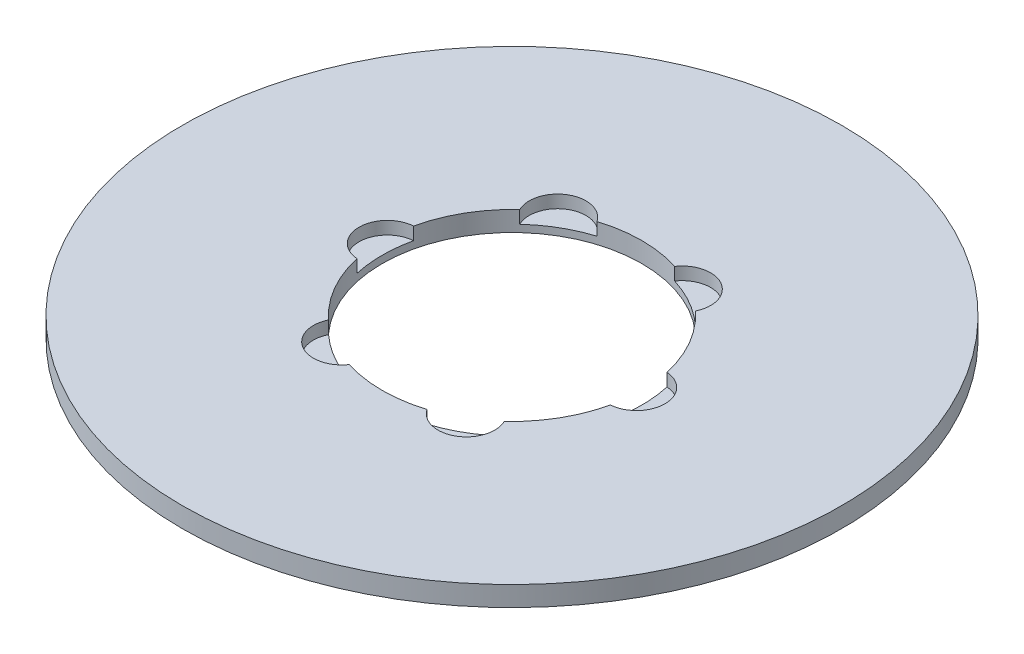
ISO-10303-21;
HEADER;
FILE_DESCRIPTION(('STEP AP214'),'2;1');
FILE_NAME('part.step','',(''),(''),'','','');
FILE_SCHEMA(('AUTOMOTIVE_DESIGN { 1 0 10303 214 1 1 1 1 }'));
ENDSEC;
DATA;
#1=APPLICATION_CONTEXT('core data for automotive mechanical design processes');
#2=APPLICATION_PROTOCOL_DEFINITION('international standard','automotive_design',2000,#1);
#3=PRODUCT_CONTEXT('',#1,'mechanical');
#4=PRODUCT('Part','Part','',(#3));
#5=PRODUCT_RELATED_PRODUCT_CATEGORY('part','',(#4));
#6=PRODUCT_DEFINITION_FORMATION('','',#4);
#7=PRODUCT_DEFINITION_CONTEXT('part definition',#1,'design');
#8=PRODUCT_DEFINITION('design','',#6,#7);
#9=PRODUCT_DEFINITION_SHAPE('','',#8);
#10=(LENGTH_UNIT() NAMED_UNIT(*) SI_UNIT(.MILLI.,.METRE.));
#11=(NAMED_UNIT(*) PLANE_ANGLE_UNIT() SI_UNIT($,.RADIAN.));
#12=(NAMED_UNIT(*) SI_UNIT($,.STERADIAN.) SOLID_ANGLE_UNIT());
#13=UNCERTAINTY_MEASURE_WITH_UNIT(LENGTH_MEASURE(1.E-05),#10,'distance_accuracy_value','');
#14=(GEOMETRIC_REPRESENTATION_CONTEXT(3) GLOBAL_UNCERTAINTY_ASSIGNED_CONTEXT((#13)) GLOBAL_UNIT_ASSIGNED_CONTEXT((#10,
#11,#12)) REPRESENTATION_CONTEXT('',''));
#15=CARTESIAN_POINT('',(0.,0.,0.));
#16=DIRECTION('',(0.,0.,1.));
#17=DIRECTION('',(1.,0.,0.));
#18=AXIS2_PLACEMENT_3D('',#15,#16,#17);
#19=CARTESIAN_POINT('',(0.,5.,0.));
#20=DIRECTION('',(0.,-1.,0.));
#21=DIRECTION('',(0.,0.,-1.));
#22=AXIS2_PLACEMENT_3D('',#19,#20,#21);
#23=CYLINDRICAL_SURFACE('',#22,82.5);
#24=CARTESIAN_POINT('',(0.,5.,0.));
#25=DIRECTION('',(0.,1.,0.));
#26=DIRECTION('',(0.,0.,1.));
#27=AXIS2_PLACEMENT_3D('',#24,#25,#26);
#28=CIRCLE('',#27,82.5);
#29=CARTESIAN_POINT('',(0.,5.,82.5));
#30=VERTEX_POINT('',#29);
#31=EDGE_CURVE('E162',#30,#30,#28,.T.);
#32=ORIENTED_EDGE('',*,*,#31,.F.);
#33=EDGE_LOOP('',(#32));
#34=FACE_BOUND('',#33,.T.);
#35=CARTESIAN_POINT('',(0.,0.,0.));
#36=DIRECTION('',(0.,1.,0.));
#37=DIRECTION('',(0.,0.,1.));
#38=AXIS2_PLACEMENT_3D('',#35,#36,#37);
#39=CIRCLE('',#38,82.5);
#40=CARTESIAN_POINT('',(0.,0.,82.5));
#41=VERTEX_POINT('',#40);
#42=EDGE_CURVE('E157',#41,#41,#39,.T.);
#43=ORIENTED_EDGE('',*,*,#42,.T.);
#44=EDGE_LOOP('',(#43));
#45=FACE_BOUND('',#44,.T.);
#46=ADVANCED_FACE('F39',(#34,#45),#23,.T.);
#47=CARTESIAN_POINT('',(0.,5.,0.));
#48=DIRECTION('',(0.,1.,0.));
#49=DIRECTION('',(0.,0.,1.));
#50=AXIS2_PLACEMENT_3D('',#47,#48,#49);
#51=PLANE('',#50);
#52=CARTESIAN_POINT('',(-15.5945976279133,5.,-27.0106354151382));
#53=DIRECTION('',(0.,1.,0.));
#54=DIRECTION('',(-0.866025403784433,0.,0.50000000000001));
#55=AXIS2_PLACEMENT_3D('',#52,#53,#54);
#56=CIRCLE('',#55,7.10755205793293);
#57=CARTESIAN_POINT('',(-9.72056549044768,5.,-31.0122654210543));
#58=VERTEX_POINT('',#57);
#59=CARTESIAN_POINT('',(-21.9971269383154,5.,-23.9243893644047));
#60=VERTEX_POINT('',#59);
#61=EDGE_CURVE('E218',#58,#60,#56,.T.);
#62=ORIENTED_EDGE('',*,*,#61,.F.);
#63=CARTESIAN_POINT('',(0.,5.,0.));
#64=DIRECTION('',(0.,1.,0.));
#65=DIRECTION('',(0.,0.,1.));
#66=AXIS2_PLACEMENT_3D('',#63,#64,#65);
#67=CIRCLE('',#66,32.5);
#68=CARTESIAN_POINT('',(9.72056549044703,5.,-31.0122654210545));
#69=VERTEX_POINT('',#68);
#70=EDGE_CURVE('E169',#69,#58,#67,.T.);
#71=ORIENTED_EDGE('',*,*,#70,.F.);
#72=CARTESIAN_POINT('',(15.5945976279127,5.,-27.0106354151385));
#73=DIRECTION('',(0.,1.,0.));
#74=DIRECTION('',(-0.866025403784443,0.,-0.499999999999992));
#75=AXIS2_PLACEMENT_3D('',#72,#73,#74);
#76=CIRCLE('',#75,7.10755205793293);
#77=CARTESIAN_POINT('',(21.9971269383149,5.,-23.9243893644051));
#78=VERTEX_POINT('',#77);
#79=EDGE_CURVE('E285',#78,#69,#76,.T.);
#80=ORIENTED_EDGE('',*,*,#79,.F.);
#81=CARTESIAN_POINT('',(31.7176924287625,5.,-7.08787605664946));
#82=VERTEX_POINT('',#81);
#83=EDGE_CURVE('E174',#82,#78,#67,.T.);
#84=ORIENTED_EDGE('',*,*,#83,.F.);
#85=CARTESIAN_POINT('',(31.189195255826,5.,0.));
#86=DIRECTION('',(0.,1.,0.));
#87=DIRECTION('',(0.,0.,-1.));
#88=AXIS2_PLACEMENT_3D('',#85,#86,#87);
#89=CIRCLE('',#88,7.10755205793293);
#90=CARTESIAN_POINT('',(31.7176924287625,5.,7.08787605664946));
#91=VERTEX_POINT('',#90);
#92=EDGE_CURVE('E280',#91,#82,#89,.T.);
#93=ORIENTED_EDGE('',*,*,#92,.F.);
#94=CARTESIAN_POINT('',(21.9971269383152,5.,23.9243893644048));
#95=VERTEX_POINT('',#94);
#96=EDGE_CURVE('E164',#95,#91,#67,.T.);
#97=ORIENTED_EDGE('',*,*,#96,.F.);
#98=CARTESIAN_POINT('',(15.5945976279131,5.,27.0106354151383));
#99=DIRECTION('',(0.,1.,0.));
#100=DIRECTION('',(0.866025403784436,0.,-0.500000000000004));
#101=AXIS2_PLACEMENT_3D('',#98,#99,#100);
#102=CIRCLE('',#101,7.10755205793293);
#103=CARTESIAN_POINT('',(9.72056549044746,5.,31.0122654210543));
#104=VERTEX_POINT('',#103);
#105=EDGE_CURVE('E269',#104,#95,#102,.T.);
#106=ORIENTED_EDGE('',*,*,#105,.F.);
#107=CARTESIAN_POINT('',(-9.72056549044725,5.,31.0122654210544));
#108=VERTEX_POINT('',#107);
#109=EDGE_CURVE('E149',#108,#104,#67,.T.);
#110=ORIENTED_EDGE('',*,*,#109,.F.);
#111=CARTESIAN_POINT('',(-15.5945976279129,5.,27.0106354151384));
#112=DIRECTION('',(0.,1.,0.));
#113=DIRECTION('',(0.86602540378444,0.,0.499999999999998));
#114=AXIS2_PLACEMENT_3D('',#111,#112,#113);
#115=CIRCLE('',#114,7.10755205793293);
#116=CARTESIAN_POINT('',(-21.9971269383151,5.,23.924389364405));
#117=VERTEX_POINT('',#116);
#118=EDGE_CURVE('E128',#117,#108,#115,.T.);
#119=ORIENTED_EDGE('',*,*,#118,.F.);
#120=CARTESIAN_POINT('',(-31.7176924287625,5.,7.08787605664946));
#121=VERTEX_POINT('',#120);
#122=EDGE_CURVE('E148',#121,#117,#67,.T.);
#123=ORIENTED_EDGE('',*,*,#122,.F.);
#124=CARTESIAN_POINT('',(-31.189195255826,5.,0.));
#125=DIRECTION('',(0.,1.,0.));
#126=DIRECTION('',(0.,0.,1.));
#127=AXIS2_PLACEMENT_3D('',#124,#125,#126);
#128=CIRCLE('',#127,7.10755205793293);
#129=CARTESIAN_POINT('',(-31.7176924287625,5.,-7.08787605664946));
#130=VERTEX_POINT('',#129);
#131=EDGE_CURVE('E179',#130,#121,#128,.T.);
#132=ORIENTED_EDGE('',*,*,#131,.F.);
#133=EDGE_CURVE('E161',#60,#130,#67,.T.);
#134=ORIENTED_EDGE('',*,*,#133,.F.);
#135=EDGE_LOOP('',(#62,#71,#80,#84,#93,#97,#106,#110,#119,#123,#132,#134));
#136=FACE_BOUND('',#135,.T.);
#137=ORIENTED_EDGE('',*,*,#31,.T.);
#138=EDGE_LOOP('',(#137));
#139=FACE_BOUND('',#138,.T.);
#140=ADVANCED_FACE('F141',(#136,#139),#51,.T.);
#141=CARTESIAN_POINT('',(0.,0.,0.));
#142=DIRECTION('',(0.,1.,0.));
#143=DIRECTION('',(0.,0.,1.));
#144=AXIS2_PLACEMENT_3D('',#141,#142,#143);
#145=PLANE('',#144);
#146=CARTESIAN_POINT('',(0.,0.,0.));
#147=DIRECTION('',(0.,1.,0.));
#148=DIRECTION('',(0.,0.,1.));
#149=AXIS2_PLACEMENT_3D('',#146,#147,#148);
#150=CIRCLE('',#149,32.5);
#151=CARTESIAN_POINT('',(0.,0.,32.5));
#152=VERTEX_POINT('',#151);
#153=EDGE_CURVE('E166',#152,#152,#150,.T.);
#154=ORIENTED_EDGE('',*,*,#153,.T.);
#155=EDGE_LOOP('',(#154));
#156=FACE_BOUND('',#155,.T.);
#157=ORIENTED_EDGE('',*,*,#42,.F.);
#158=EDGE_LOOP('',(#157));
#159=FACE_BOUND('',#158,.T.);
#160=ADVANCED_FACE('F234',(#156,#159),#145,.F.);
#161=CARTESIAN_POINT('',(0.,5.,0.));
#162=DIRECTION('',(0.,-1.,0.));
#163=DIRECTION('',(0.,0.,-1.));
#164=AXIS2_PLACEMENT_3D('',#161,#162,#163);
#165=CYLINDRICAL_SURFACE('',#164,32.5);
#166=DIRECTION('',(0.,1.,0.));
#167=VECTOR('',#166,1.);
#168=CARTESIAN_POINT('',(-9.72056549044768,3.40938360543745,-31.0122654210543));
#169=LINE('',#168,#167);
#170=CARTESIAN_POINT('',(-9.72056549044768,1.81876721087489,-31.0122654210543));
#171=VERTEX_POINT('',#170);
#172=EDGE_CURVE('E11',#171,#58,#169,.T.);
#173=ORIENTED_EDGE('',*,*,#172,.F.);
#174=CARTESIAN_POINT('',(0.,1.81876721087489,0.));
#175=DIRECTION('',(0.,1.,0.));
#176=DIRECTION('',(0.,0.,1.));
#177=AXIS2_PLACEMENT_3D('',#174,#175,#176);
#178=CIRCLE('',#177,32.5);
#179=CARTESIAN_POINT('',(-21.9971269383154,1.81876721087489,-23.9243893644047));
#180=VERTEX_POINT('',#179);
#181=EDGE_CURVE('E214',#171,#180,#178,.T.);
#182=ORIENTED_EDGE('',*,*,#181,.T.);
#183=DIRECTION('',(0.,1.,0.));
#184=VECTOR('',#183,1.);
#185=CARTESIAN_POINT('',(-21.9971269383154,3.40938360543745,-23.9243893644046));
#186=LINE('',#185,#184);
#187=EDGE_CURVE('E46',#60,#180,#186,.F.);
#188=ORIENTED_EDGE('',*,*,#187,.F.);
#189=ORIENTED_EDGE('',*,*,#133,.T.);
#190=DIRECTION('',(0.,1.,0.));
#191=VECTOR('',#190,1.);
#192=CARTESIAN_POINT('',(-31.7176924287625,3.40938360543745,-7.08787605664946));
#193=LINE('',#192,#191);
#194=CARTESIAN_POINT('',(-31.7176924287625,1.81876721087489,-7.08787605664946));
#195=VERTEX_POINT('',#194);
#196=EDGE_CURVE('E187',#195,#130,#193,.T.);
#197=ORIENTED_EDGE('',*,*,#196,.F.);
#198=CARTESIAN_POINT('',(0.,1.81876721087489,0.));
#199=DIRECTION('',(0.,1.,0.));
#200=DIRECTION('',(0.,0.,1.));
#201=AXIS2_PLACEMENT_3D('',#198,#199,#200);
#202=CIRCLE('',#201,32.5);
#203=CARTESIAN_POINT('',(-31.7176924287625,1.81876721087489,7.08787605664946));
#204=VERTEX_POINT('',#203);
#205=EDGE_CURVE('E184',#195,#204,#202,.T.);
#206=ORIENTED_EDGE('',*,*,#205,.T.);
#207=DIRECTION('',(0.,1.,0.));
#208=VECTOR('',#207,1.);
#209=CARTESIAN_POINT('',(-31.7176924287625,3.40938360543745,7.08787605664946));
#210=LINE('',#209,#208);
#211=EDGE_CURVE('E158',#121,#204,#210,.F.);
#212=ORIENTED_EDGE('',*,*,#211,.F.);
#213=ORIENTED_EDGE('',*,*,#122,.T.);
#214=DIRECTION('',(0.,1.,0.));
#215=VECTOR('',#214,1.);
#216=CARTESIAN_POINT('',(-21.9971269383151,3.40938360543745,23.924389364405));
#217=LINE('',#216,#215);
#218=CARTESIAN_POINT('',(-21.9971269383151,1.81876721087489,23.924389364405));
#219=VERTEX_POINT('',#218);
#220=EDGE_CURVE('E127',#219,#117,#217,.T.);
#221=ORIENTED_EDGE('',*,*,#220,.F.);
#222=CARTESIAN_POINT('',(0.,1.81876721087489,0.));
#223=DIRECTION('',(0.,1.,0.));
#224=DIRECTION('',(0.,0.,1.));
#225=AXIS2_PLACEMENT_3D('',#222,#223,#224);
#226=CIRCLE('',#225,32.5);
#227=CARTESIAN_POINT('',(-9.72056549044725,1.81876721087489,31.0122654210544));
#228=VERTEX_POINT('',#227);
#229=EDGE_CURVE('E189',#219,#228,#226,.T.);
#230=ORIENTED_EDGE('',*,*,#229,.T.);
#231=DIRECTION('',(0.,1.,0.));
#232=VECTOR('',#231,1.);
#233=CARTESIAN_POINT('',(-9.72056549044725,3.40938360543745,31.0122654210544));
#234=LINE('',#233,#232);
#235=EDGE_CURVE('E140',#108,#228,#234,.F.);
#236=ORIENTED_EDGE('',*,*,#235,.F.);
#237=ORIENTED_EDGE('',*,*,#109,.T.);
#238=DIRECTION('',(0.,1.,0.));
#239=VECTOR('',#238,1.);
#240=CARTESIAN_POINT('',(9.72056549044746,3.40938360543745,31.0122654210543));
#241=LINE('',#240,#239);
#242=CARTESIAN_POINT('',(9.72056549044746,1.81876721087489,31.0122654210543));
#243=VERTEX_POINT('',#242);
#244=EDGE_CURVE('E196',#243,#104,#241,.T.);
#245=ORIENTED_EDGE('',*,*,#244,.F.);
#246=CARTESIAN_POINT('',(0.,1.81876721087489,0.));
#247=DIRECTION('',(0.,1.,0.));
#248=DIRECTION('',(0.,0.,1.));
#249=AXIS2_PLACEMENT_3D('',#246,#247,#248);
#250=CIRCLE('',#249,32.5);
#251=CARTESIAN_POINT('',(21.9971269383152,1.81876721087489,23.9243893644048));
#252=VERTEX_POINT('',#251);
#253=EDGE_CURVE('E136',#243,#252,#250,.T.);
#254=ORIENTED_EDGE('',*,*,#253,.T.);
#255=DIRECTION('',(0.,1.,0.));
#256=VECTOR('',#255,1.);
#257=CARTESIAN_POINT('',(21.9971269383152,3.40938360543745,23.9243893644048));
#258=LINE('',#257,#256);
#259=EDGE_CURVE('E194',#95,#252,#258,.F.);
#260=ORIENTED_EDGE('',*,*,#259,.F.);
#261=ORIENTED_EDGE('',*,*,#96,.T.);
#262=DIRECTION('',(0.,1.,0.));
#263=VECTOR('',#262,1.);
#264=CARTESIAN_POINT('',(31.7176924287625,3.40938360543745,7.08787605664946));
#265=LINE('',#264,#263);
#266=CARTESIAN_POINT('',(31.7176924287625,1.81876721087489,7.08787605664946));
#267=VERTEX_POINT('',#266);
#268=EDGE_CURVE('E206',#267,#91,#265,.T.);
#269=ORIENTED_EDGE('',*,*,#268,.F.);
#270=CARTESIAN_POINT('',(0.,1.81876721087489,0.));
#271=DIRECTION('',(0.,1.,0.));
#272=DIRECTION('',(0.,0.,1.));
#273=AXIS2_PLACEMENT_3D('',#270,#271,#272);
#274=CIRCLE('',#273,32.5);
#275=CARTESIAN_POINT('',(31.7176924287625,1.81876721087489,-7.08787605664946));
#276=VERTEX_POINT('',#275);
#277=EDGE_CURVE('E199',#267,#276,#274,.T.);
#278=ORIENTED_EDGE('',*,*,#277,.T.);
#279=DIRECTION('',(0.,1.,0.));
#280=VECTOR('',#279,1.);
#281=CARTESIAN_POINT('',(31.7176924287625,3.40938360543745,-7.08787605664946));
#282=LINE('',#281,#280);
#283=EDGE_CURVE('E201',#82,#276,#282,.F.);
#284=ORIENTED_EDGE('',*,*,#283,.F.);
#285=ORIENTED_EDGE('',*,*,#83,.T.);
#286=DIRECTION('',(0.,1.,0.));
#287=VECTOR('',#286,1.);
#288=CARTESIAN_POINT('',(21.9971269383149,3.40938360543745,-23.9243893644051));
#289=LINE('',#288,#287);
#290=CARTESIAN_POINT('',(21.9971269383149,1.81876721087489,-23.9243893644051));
#291=VERTEX_POINT('',#290);
#292=EDGE_CURVE('E213',#291,#78,#289,.T.);
#293=ORIENTED_EDGE('',*,*,#292,.F.);
#294=CARTESIAN_POINT('',(0.,1.81876721087489,0.));
#295=DIRECTION('',(0.,1.,0.));
#296=DIRECTION('',(0.,0.,1.));
#297=AXIS2_PLACEMENT_3D('',#294,#295,#296);
#298=CIRCLE('',#297,32.5);
#299=CARTESIAN_POINT('',(9.72056549044703,1.81876721087489,-31.0122654210545));
#300=VERTEX_POINT('',#299);
#301=EDGE_CURVE('E208',#291,#300,#298,.T.);
#302=ORIENTED_EDGE('',*,*,#301,.T.);
#303=DIRECTION('',(0.,1.,0.));
#304=VECTOR('',#303,1.);
#305=CARTESIAN_POINT('',(9.72056549044703,3.40938360543745,-31.0122654210545));
#306=LINE('',#305,#304);
#307=EDGE_CURVE('E211',#69,#300,#306,.F.);
#308=ORIENTED_EDGE('',*,*,#307,.F.);
#309=ORIENTED_EDGE('',*,*,#70,.T.);
#310=EDGE_LOOP('',(#173,#182,#188,#189,#197,#206,#212,#213,#221,#230,#236,#237,#245,#254,#260,
#261,#269,#278,#284,#285,#293,#302,#308,#309));
#311=FACE_BOUND('',#310,.T.);
#312=ORIENTED_EDGE('',*,*,#153,.F.);
#313=EDGE_LOOP('',(#312));
#314=FACE_BOUND('',#313,.T.);
#315=ADVANCED_FACE('F152',(#311,#314),#165,.F.);
#316=CARTESIAN_POINT('',(-31.189195255826,1.81876721087489,0.));
#317=DIRECTION('',(0.,1.,0.));
#318=DIRECTION('',(0.,0.,1.));
#319=AXIS2_PLACEMENT_3D('',#316,#317,#318);
#320=CYLINDRICAL_SURFACE('',#319,7.10755205793293);
#321=ORIENTED_EDGE('',*,*,#196,.T.);
#322=ORIENTED_EDGE('',*,*,#131,.T.);
#323=ORIENTED_EDGE('',*,*,#211,.T.);
#324=CARTESIAN_POINT('',(-31.189195255826,1.81876721087489,0.));
#325=DIRECTION('',(0.,1.,0.));
#326=DIRECTION('',(0.,0.,1.));
#327=AXIS2_PLACEMENT_3D('',#324,#325,#326);
#328=CIRCLE('',#327,7.10755205793293);
#329=EDGE_CURVE('E180',#195,#204,#328,.T.);
#330=ORIENTED_EDGE('',*,*,#329,.F.);
#331=EDGE_LOOP('',(#321,#322,#323,#330));
#332=FACE_BOUND('',#331,.T.);
#333=ADVANCED_FACE('F244',(#332),#320,.F.);
#334=CARTESIAN_POINT('',(-31.189195255826,1.81876721087489,0.));
#335=DIRECTION('',(0.,1.,0.));
#336=DIRECTION('',(0.,0.,1.));
#337=AXIS2_PLACEMENT_3D('',#334,#335,#336);
#338=PLANE('',#337);
#339=ORIENTED_EDGE('',*,*,#329,.T.);
#340=ORIENTED_EDGE('',*,*,#205,.F.);
#341=EDGE_LOOP('',(#339,#340));
#342=FACE_BOUND('',#341,.T.);
#343=ADVANCED_FACE('F248',(#342),#338,.T.);
#344=CARTESIAN_POINT('',(-15.5945976279129,1.81876721087489,27.0106354151384));
#345=DIRECTION('',(0.,1.,0.));
#346=DIRECTION('',(0.,0.,1.));
#347=AXIS2_PLACEMENT_3D('',#344,#345,#346);
#348=CYLINDRICAL_SURFACE('',#347,7.10755205793293);
#349=ORIENTED_EDGE('',*,*,#220,.T.);
#350=ORIENTED_EDGE('',*,*,#118,.T.);
#351=ORIENTED_EDGE('',*,*,#235,.T.);
#352=CARTESIAN_POINT('',(-15.5945976279129,1.81876721087489,27.0106354151384));
#353=DIRECTION('',(0.,1.,0.));
#354=DIRECTION('',(0.86602540378444,0.,0.499999999999998));
#355=AXIS2_PLACEMENT_3D('',#352,#353,#354);
#356=CIRCLE('',#355,7.10755205793293);
#357=EDGE_CURVE('E135',#219,#228,#356,.T.);
#358=ORIENTED_EDGE('',*,*,#357,.F.);
#359=EDGE_LOOP('',(#349,#350,#351,#358));
#360=FACE_BOUND('',#359,.T.);
#361=ADVANCED_FACE('F126',(#360),#348,.F.);
#362=CARTESIAN_POINT('',(-15.5945976279129,1.81876721087489,27.0106354151384));
#363=DIRECTION('',(0.,1.,0.));
#364=DIRECTION('',(0.86602540378444,0.,0.499999999999998));
#365=AXIS2_PLACEMENT_3D('',#362,#363,#364);
#366=PLANE('',#365);
#367=ORIENTED_EDGE('',*,*,#357,.T.);
#368=ORIENTED_EDGE('',*,*,#229,.F.);
#369=EDGE_LOOP('',(#367,#368));
#370=FACE_BOUND('',#369,.T.);
#371=ADVANCED_FACE('F258',(#370),#366,.T.);
#372=CARTESIAN_POINT('',(15.5945976279131,1.81876721087489,27.0106354151383));
#373=DIRECTION('',(0.,1.,0.));
#374=DIRECTION('',(0.,0.,1.));
#375=AXIS2_PLACEMENT_3D('',#372,#373,#374);
#376=CYLINDRICAL_SURFACE('',#375,7.10755205793293);
#377=ORIENTED_EDGE('',*,*,#244,.T.);
#378=ORIENTED_EDGE('',*,*,#105,.T.);
#379=ORIENTED_EDGE('',*,*,#259,.T.);
#380=CARTESIAN_POINT('',(15.5945976279131,1.81876721087489,27.0106354151383));
#381=DIRECTION('',(0.,1.,0.));
#382=DIRECTION('',(0.866025403784436,0.,-0.500000000000004));
#383=AXIS2_PLACEMENT_3D('',#380,#381,#382);
#384=CIRCLE('',#383,7.10755205793293);
#385=EDGE_CURVE('E147',#243,#252,#384,.T.);
#386=ORIENTED_EDGE('',*,*,#385,.F.);
#387=EDGE_LOOP('',(#377,#378,#379,#386));
#388=FACE_BOUND('',#387,.T.);
#389=ADVANCED_FACE('F256',(#388),#376,.F.);
#390=CARTESIAN_POINT('',(15.5945976279131,1.81876721087489,27.0106354151383));
#391=DIRECTION('',(0.,1.,0.));
#392=DIRECTION('',(0.866025403784436,0.,-0.500000000000004));
#393=AXIS2_PLACEMENT_3D('',#390,#391,#392);
#394=PLANE('',#393);
#395=ORIENTED_EDGE('',*,*,#385,.T.);
#396=ORIENTED_EDGE('',*,*,#253,.F.);
#397=EDGE_LOOP('',(#395,#396));
#398=FACE_BOUND('',#397,.T.);
#399=ADVANCED_FACE('F263',(#398),#394,.T.);
#400=CARTESIAN_POINT('',(31.189195255826,1.81876721087489,0.));
#401=DIRECTION('',(0.,1.,0.));
#402=DIRECTION('',(0.,0.,1.));
#403=AXIS2_PLACEMENT_3D('',#400,#401,#402);
#404=CYLINDRICAL_SURFACE('',#403,7.10755205793293);
#405=ORIENTED_EDGE('',*,*,#268,.T.);
#406=ORIENTED_EDGE('',*,*,#92,.T.);
#407=ORIENTED_EDGE('',*,*,#283,.T.);
#408=CARTESIAN_POINT('',(31.189195255826,1.81876721087489,0.));
#409=DIRECTION('',(0.,1.,0.));
#410=DIRECTION('',(0.,0.,-1.));
#411=AXIS2_PLACEMENT_3D('',#408,#409,#410);
#412=CIRCLE('',#411,7.10755205793293);
#413=EDGE_CURVE('E273',#267,#276,#412,.T.);
#414=ORIENTED_EDGE('',*,*,#413,.F.);
#415=EDGE_LOOP('',(#405,#406,#407,#414));
#416=FACE_BOUND('',#415,.T.);
#417=ADVANCED_FACE('F297',(#416),#404,.F.);
#418=CARTESIAN_POINT('',(31.189195255826,1.81876721087489,0.));
#419=DIRECTION('',(0.,1.,0.));
#420=DIRECTION('',(0.,0.,-1.));
#421=AXIS2_PLACEMENT_3D('',#418,#419,#420);
#422=PLANE('',#421);
#423=ORIENTED_EDGE('',*,*,#413,.T.);
#424=ORIENTED_EDGE('',*,*,#277,.F.);
#425=EDGE_LOOP('',(#423,#424));
#426=FACE_BOUND('',#425,.T.);
#427=ADVANCED_FACE('F299',(#426),#422,.T.);
#428=CARTESIAN_POINT('',(15.5945976279127,1.81876721087489,-27.0106354151385));
#429=DIRECTION('',(0.,1.,0.));
#430=DIRECTION('',(0.,0.,1.));
#431=AXIS2_PLACEMENT_3D('',#428,#429,#430);
#432=CYLINDRICAL_SURFACE('',#431,7.10755205793293);
#433=ORIENTED_EDGE('',*,*,#292,.T.);
#434=ORIENTED_EDGE('',*,*,#79,.T.);
#435=ORIENTED_EDGE('',*,*,#307,.T.);
#436=CARTESIAN_POINT('',(15.5945976279127,1.81876721087489,-27.0106354151385));
#437=DIRECTION('',(0.,1.,0.));
#438=DIRECTION('',(-0.866025403784443,0.,-0.499999999999992));
#439=AXIS2_PLACEMENT_3D('',#436,#437,#438);
#440=CIRCLE('',#439,7.10755205793293);
#441=EDGE_CURVE('E56',#291,#300,#440,.T.);
#442=ORIENTED_EDGE('',*,*,#441,.F.);
#443=EDGE_LOOP('',(#433,#434,#435,#442));
#444=FACE_BOUND('',#443,.T.);
#445=ADVANCED_FACE('F292',(#444),#432,.F.);
#446=CARTESIAN_POINT('',(15.5945976279127,1.81876721087489,-27.0106354151385));
#447=DIRECTION('',(0.,1.,0.));
#448=DIRECTION('',(-0.866025403784443,0.,-0.499999999999992));
#449=AXIS2_PLACEMENT_3D('',#446,#447,#448);
#450=PLANE('',#449);
#451=ORIENTED_EDGE('',*,*,#441,.T.);
#452=ORIENTED_EDGE('',*,*,#301,.F.);
#453=EDGE_LOOP('',(#451,#452));
#454=FACE_BOUND('',#453,.T.);
#455=ADVANCED_FACE('F226',(#454),#450,.T.);
#456=CARTESIAN_POINT('',(-15.5945976279133,1.81876721087489,-27.0106354151382));
#457=DIRECTION('',(0.,1.,0.));
#458=DIRECTION('',(0.,0.,1.));
#459=AXIS2_PLACEMENT_3D('',#456,#457,#458);
#460=CYLINDRICAL_SURFACE('',#459,7.10755205793293);
#461=ORIENTED_EDGE('',*,*,#172,.T.);
#462=ORIENTED_EDGE('',*,*,#61,.T.);
#463=ORIENTED_EDGE('',*,*,#187,.T.);
#464=CARTESIAN_POINT('',(-15.5945976279133,1.81876721087489,-27.0106354151382));
#465=DIRECTION('',(0.,1.,0.));
#466=DIRECTION('',(-0.866025403784433,0.,0.50000000000001));
#467=AXIS2_PLACEMENT_3D('',#464,#465,#466);
#468=CIRCLE('',#467,7.10755205793293);
#469=EDGE_CURVE('E55',#171,#180,#468,.T.);
#470=ORIENTED_EDGE('',*,*,#469,.F.);
#471=EDGE_LOOP('',(#461,#462,#463,#470));
#472=FACE_BOUND('',#471,.T.);
#473=ADVANCED_FACE('F217',(#472),#460,.F.);
#474=CARTESIAN_POINT('',(-15.5945976279133,1.81876721087489,-27.0106354151382));
#475=DIRECTION('',(0.,1.,0.));
#476=DIRECTION('',(-0.866025403784433,0.,0.50000000000001));
#477=AXIS2_PLACEMENT_3D('',#474,#475,#476);
#478=PLANE('',#477);
#479=ORIENTED_EDGE('',*,*,#469,.T.);
#480=ORIENTED_EDGE('',*,*,#181,.F.);
#481=EDGE_LOOP('',(#479,#480));
#482=FACE_BOUND('',#481,.T.);
#483=ADVANCED_FACE('F219',(#482),#478,.T.);
#484=CLOSED_SHELL('',(#46,#140,#160,#315,#333,#343,#361,#371,#389,#399,#417,#427,#445,#455,#473,#483));
#485=MANIFOLD_SOLID_BREP('B2',#484);
#486=ADVANCED_BREP_SHAPE_REPRESENTATION('',(#18,#485),#14);
#487=SHAPE_DEFINITION_REPRESENTATION(#9,#486);
ENDSEC;
END-ISO-10303-21;
